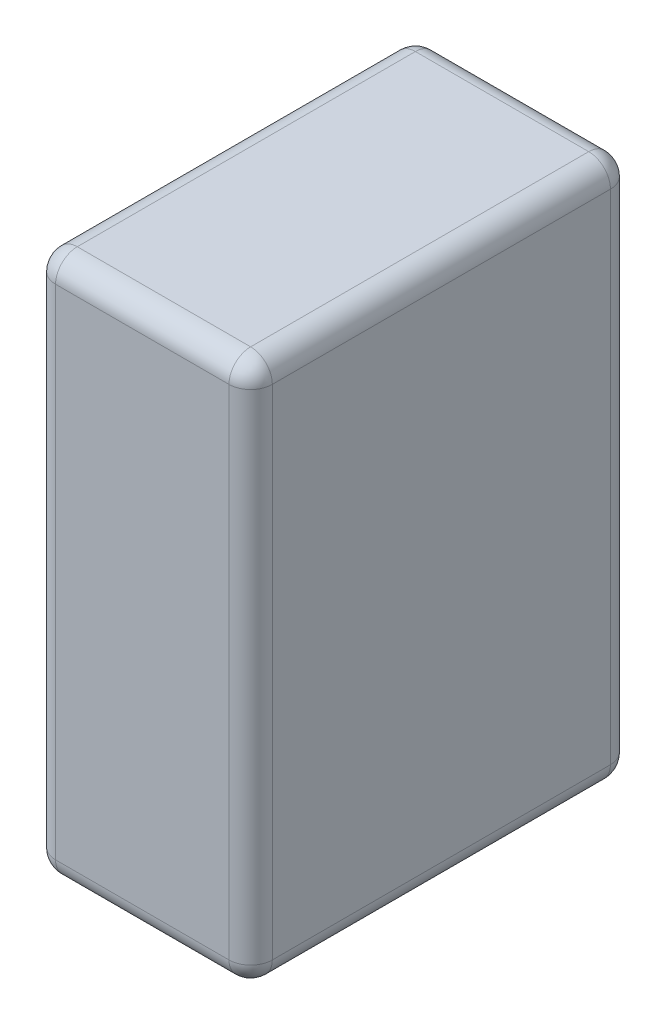
ISO-10303-21;
HEADER;
FILE_DESCRIPTION(('STEP AP214'),'2;1');
FILE_NAME('part.step','',(''),(''),'','','');
FILE_SCHEMA(('AUTOMOTIVE_DESIGN { 1 0 10303 214 1 1 1 1 }'));
ENDSEC;
DATA;
#1=APPLICATION_CONTEXT('core data for automotive mechanical design processes');
#2=APPLICATION_PROTOCOL_DEFINITION('international standard','automotive_design',2000,#1);
#3=PRODUCT_CONTEXT('',#1,'mechanical');
#4=PRODUCT('Part','Part','',(#3));
#5=PRODUCT_RELATED_PRODUCT_CATEGORY('part','',(#4));
#6=PRODUCT_DEFINITION_FORMATION('','',#4);
#7=PRODUCT_DEFINITION_CONTEXT('part definition',#1,'design');
#8=PRODUCT_DEFINITION('design','',#6,#7);
#9=PRODUCT_DEFINITION_SHAPE('','',#8);
#10=(LENGTH_UNIT() NAMED_UNIT(*) SI_UNIT(.MILLI.,.METRE.));
#11=(NAMED_UNIT(*) PLANE_ANGLE_UNIT() SI_UNIT($,.RADIAN.));
#12=(NAMED_UNIT(*) SI_UNIT($,.STERADIAN.) SOLID_ANGLE_UNIT());
#13=UNCERTAINTY_MEASURE_WITH_UNIT(LENGTH_MEASURE(1.E-05),#10,'distance_accuracy_value','');
#14=(GEOMETRIC_REPRESENTATION_CONTEXT(3) GLOBAL_UNCERTAINTY_ASSIGNED_CONTEXT((#13)) GLOBAL_UNIT_ASSIGNED_CONTEXT((#10,
#11,#12)) REPRESENTATION_CONTEXT('',''));
#15=CARTESIAN_POINT('',(0.,0.,0.));
#16=DIRECTION('',(0.,0.,1.));
#17=DIRECTION('',(1.,0.,0.));
#18=AXIS2_PLACEMENT_3D('',#15,#16,#17);
#19=CARTESIAN_POINT('',(0.5,-0.625,0.));
#20=DIRECTION('',(1.,0.,0.));
#21=DIRECTION('',(0.,0.,1.));
#22=AXIS2_PLACEMENT_3D('',#19,#20,#21);
#23=PLANE('',#22);
#24=DIRECTION('',(0.,1.,0.));
#25=VECTOR('',#24,1.);
#26=CARTESIAN_POINT('',(0.5,-0.575,0.83));
#27=LINE('',#26,#25);
#28=CARTESIAN_POINT('',(0.5,-0.575,0.83));
#29=VERTEX_POINT('',#28);
#30=CARTESIAN_POINT('',(0.5,0.575,0.83));
#31=VERTEX_POINT('',#30);
#32=EDGE_CURVE('E11',#29,#31,#27,.T.);
#33=ORIENTED_EDGE('',*,*,#32,.T.);
#34=DIRECTION('',(0.,0.,1.));
#35=VECTOR('',#34,1.);
#36=CARTESIAN_POINT('',(0.5,0.575,0.05));
#37=LINE('',#36,#35);
#38=CARTESIAN_POINT('',(0.5,0.575,0.05));
#39=VERTEX_POINT('',#38);
#40=EDGE_CURVE('E241',#39,#31,#37,.T.);
#41=ORIENTED_EDGE('',*,*,#40,.F.);
#42=DIRECTION('',(0.,1.,0.));
#43=VECTOR('',#42,1.);
#44=CARTESIAN_POINT('',(0.5,-0.575,0.05));
#45=LINE('',#44,#43);
#46=CARTESIAN_POINT('',(0.5,-0.575,0.05));
#47=VERTEX_POINT('',#46);
#48=EDGE_CURVE('E238',#47,#39,#45,.T.);
#49=ORIENTED_EDGE('',*,*,#48,.F.);
#50=DIRECTION('',(0.,0.,1.));
#51=VECTOR('',#50,1.);
#52=CARTESIAN_POINT('',(0.5,-0.575,0.05));
#53=LINE('',#52,#51);
#54=EDGE_CURVE('E24',#47,#29,#53,.T.);
#55=ORIENTED_EDGE('',*,*,#54,.T.);
#56=EDGE_LOOP('',(#33,#41,#49,#55));
#57=FACE_BOUND('',#56,.T.);
#58=ADVANCED_FACE('F17',(#57),#23,.F.);
#59=CARTESIAN_POINT('',(0.55,-0.575,0.));
#60=DIRECTION('',(0.,0.,1.));
#61=DIRECTION('',(-1.,0.,0.));
#62=AXIS2_PLACEMENT_3D('',#59,#60,#61);
#63=CYLINDRICAL_SURFACE('',#62,0.05);
#64=ORIENTED_EDGE('',*,*,#54,.F.);
#65=CARTESIAN_POINT('',(0.55,-0.575,0.05));
#66=DIRECTION('',(0.,0.,1.));
#67=DIRECTION('',(-1.,0.,0.));
#68=AXIS2_PLACEMENT_3D('',#65,#66,#67);
#69=CIRCLE('',#68,0.05);
#70=CARTESIAN_POINT('',(0.55,-0.625,0.05));
#71=VERTEX_POINT('',#70);
#72=EDGE_CURVE('E236',#47,#71,#69,.T.);
#73=ORIENTED_EDGE('',*,*,#72,.T.);
#74=DIRECTION('',(0.,0.,1.));
#75=VECTOR('',#74,1.);
#76=CARTESIAN_POINT('',(0.55,-0.625,0.05));
#77=LINE('',#76,#75);
#78=CARTESIAN_POINT('',(0.55,-0.625,0.83));
#79=VERTEX_POINT('',#78);
#80=EDGE_CURVE('E228',#71,#79,#77,.T.);
#81=ORIENTED_EDGE('',*,*,#80,.T.);
#82=CARTESIAN_POINT('',(0.55,-0.575,0.83));
#83=DIRECTION('',(0.,0.,1.));
#84=DIRECTION('',(-1.,0.,0.));
#85=AXIS2_PLACEMENT_3D('',#82,#83,#84);
#86=CIRCLE('',#85,0.05);
#87=EDGE_CURVE('E217',#29,#79,#86,.T.);
#88=ORIENTED_EDGE('',*,*,#87,.F.);
#89=EDGE_LOOP('',(#64,#73,#81,#88));
#90=FACE_BOUND('',#89,.T.);
#91=ADVANCED_FACE('F243',(#90),#63,.T.);
#92=CARTESIAN_POINT('',(0.55,-0.625,0.05));
#93=DIRECTION('',(0.,1.,0.));
#94=DIRECTION('',(-1.,0.,0.));
#95=AXIS2_PLACEMENT_3D('',#92,#93,#94);
#96=CYLINDRICAL_SURFACE('',#95,0.05);
#97=ORIENTED_EDGE('',*,*,#48,.T.);
#98=CARTESIAN_POINT('',(0.55,0.575,0.05));
#99=DIRECTION('',(0.,1.,0.));
#100=DIRECTION('',(0.,0.,-1.));
#101=AXIS2_PLACEMENT_3D('',#98,#99,#100);
#102=CIRCLE('',#101,0.05);
#103=CARTESIAN_POINT('',(0.55,0.575,0.));
#104=VERTEX_POINT('',#103);
#105=EDGE_CURVE('E230',#104,#39,#102,.T.);
#106=ORIENTED_EDGE('',*,*,#105,.F.);
#107=DIRECTION('',(0.,1.,0.));
#108=VECTOR('',#107,1.);
#109=CARTESIAN_POINT('',(0.55,-0.575,0.));
#110=LINE('',#109,#108);
#111=CARTESIAN_POINT('',(0.55,-0.575,0.));
#112=VERTEX_POINT('',#111);
#113=EDGE_CURVE('E220',#112,#104,#110,.T.);
#114=ORIENTED_EDGE('',*,*,#113,.F.);
#115=CARTESIAN_POINT('',(0.55,-0.575,0.05));
#116=DIRECTION('',(0.,1.,0.));
#117=DIRECTION('',(0.,0.,-1.));
#118=AXIS2_PLACEMENT_3D('',#115,#116,#117);
#119=CIRCLE('',#118,0.05);
#120=EDGE_CURVE('E205',#112,#47,#119,.T.);
#121=ORIENTED_EDGE('',*,*,#120,.T.);
#122=EDGE_LOOP('',(#97,#106,#114,#121));
#123=FACE_BOUND('',#122,.T.);
#124=ADVANCED_FACE('F270',(#123),#96,.T.);
#125=CARTESIAN_POINT('',(0.55,-0.625,0.83));
#126=DIRECTION('',(0.,1.,0.));
#127=DIRECTION('',(-1.,0.,0.));
#128=AXIS2_PLACEMENT_3D('',#125,#126,#127);
#129=CYLINDRICAL_SURFACE('',#128,0.05);
#130=CARTESIAN_POINT('',(0.55,-0.575,0.83));
#131=DIRECTION('',(0.,-1.,0.));
#132=DIRECTION('',(0.,0.,1.));
#133=AXIS2_PLACEMENT_3D('',#130,#131,#132);
#134=CIRCLE('',#133,0.05);
#135=CARTESIAN_POINT('',(0.55,-0.575,0.88));
#136=VERTEX_POINT('',#135);
#137=EDGE_CURVE('E233',#136,#29,#134,.T.);
#138=ORIENTED_EDGE('',*,*,#137,.F.);
#139=DIRECTION('',(0.,1.,0.));
#140=VECTOR('',#139,1.);
#141=CARTESIAN_POINT('',(0.55,-0.575,0.88));
#142=LINE('',#141,#140);
#143=CARTESIAN_POINT('',(0.55,0.575,0.88));
#144=VERTEX_POINT('',#143);
#145=EDGE_CURVE('E223',#136,#144,#142,.T.);
#146=ORIENTED_EDGE('',*,*,#145,.T.);
#147=CARTESIAN_POINT('',(0.55,0.575,0.83));
#148=DIRECTION('',(0.,1.,0.));
#149=DIRECTION('',(-1.,0.,0.));
#150=AXIS2_PLACEMENT_3D('',#147,#148,#149);
#151=CIRCLE('',#150,0.05);
#152=EDGE_CURVE('E208',#31,#144,#151,.T.);
#153=ORIENTED_EDGE('',*,*,#152,.F.);
#154=ORIENTED_EDGE('',*,*,#32,.F.);
#155=EDGE_LOOP('',(#138,#146,#153,#154));
#156=FACE_BOUND('',#155,.T.);
#157=ADVANCED_FACE('F251',(#156),#129,.T.);
#158=CARTESIAN_POINT('',(0.55,0.575,0.));
#159=DIRECTION('',(0.,0.,1.));
#160=DIRECTION('',(-1.,0.,0.));
#161=AXIS2_PLACEMENT_3D('',#158,#159,#160);
#162=CYLINDRICAL_SURFACE('',#161,0.05);
#163=CARTESIAN_POINT('',(0.55,0.575,0.83));
#164=DIRECTION('',(0.,0.,1.));
#165=DIRECTION('',(0.,1.,0.));
#166=AXIS2_PLACEMENT_3D('',#163,#164,#165);
#167=CIRCLE('',#166,0.05);
#168=CARTESIAN_POINT('',(0.55,0.625,0.83));
#169=VERTEX_POINT('',#168);
#170=EDGE_CURVE('E225',#169,#31,#167,.T.);
#171=ORIENTED_EDGE('',*,*,#170,.F.);
#172=DIRECTION('',(0.,0.,1.));
#173=VECTOR('',#172,1.);
#174=CARTESIAN_POINT('',(0.55,0.625,0.05));
#175=LINE('',#174,#173);
#176=CARTESIAN_POINT('',(0.55,0.625,0.05));
#177=VERTEX_POINT('',#176);
#178=EDGE_CURVE('E211',#177,#169,#175,.T.);
#179=ORIENTED_EDGE('',*,*,#178,.F.);
#180=CARTESIAN_POINT('',(0.55,0.575,0.05));
#181=DIRECTION('',(0.,0.,-1.));
#182=DIRECTION('',(-1.,0.,0.));
#183=AXIS2_PLACEMENT_3D('',#180,#181,#182);
#184=CIRCLE('',#183,0.05);
#185=EDGE_CURVE('E202',#39,#177,#184,.T.);
#186=ORIENTED_EDGE('',*,*,#185,.F.);
#187=ORIENTED_EDGE('',*,*,#40,.T.);
#188=EDGE_LOOP('',(#171,#179,#186,#187));
#189=FACE_BOUND('',#188,.T.);
#190=ADVANCED_FACE('F257',(#189),#162,.T.);
#191=CARTESIAN_POINT('',(0.55,-0.575,0.05));
#192=DIRECTION('',(0.,0.,1.));
#193=DIRECTION('',(-1.,0.,0.));
#194=AXIS2_PLACEMENT_3D('',#191,#192,#193);
#195=SPHERICAL_SURFACE('',#194,0.05);
#196=CARTESIAN_POINT('',(0.55,-0.575,0.05));
#197=DIRECTION('',(-1.,0.,0.));
#198=DIRECTION('',(0.,0.,-1.));
#199=AXIS2_PLACEMENT_3D('',#196,#197,#198);
#200=CIRCLE('',#199,0.05);
#201=EDGE_CURVE('E214',#112,#71,#200,.T.);
#202=ORIENTED_EDGE('',*,*,#201,.T.);
#203=ORIENTED_EDGE('',*,*,#72,.F.);
#204=ORIENTED_EDGE('',*,*,#120,.F.);
#205=EDGE_LOOP('',(#202,#203,#204));
#206=FACE_BOUND('',#205,.T.);
#207=ADVANCED_FACE('F275',(#206),#195,.T.);
#208=CARTESIAN_POINT('',(0.55,-0.575,0.83));
#209=DIRECTION('',(0.,0.,-1.));
#210=DIRECTION('',(-1.,0.,0.));
#211=AXIS2_PLACEMENT_3D('',#208,#209,#210);
#212=SPHERICAL_SURFACE('',#211,0.05);
#213=ORIENTED_EDGE('',*,*,#137,.T.);
#214=ORIENTED_EDGE('',*,*,#87,.T.);
#215=CARTESIAN_POINT('',(0.55,-0.575,0.83));
#216=DIRECTION('',(1.,0.,0.));
#217=DIRECTION('',(0.,0.,1.));
#218=AXIS2_PLACEMENT_3D('',#215,#216,#217);
#219=CIRCLE('',#218,0.05);
#220=EDGE_CURVE('E193',#136,#79,#219,.T.);
#221=ORIENTED_EDGE('',*,*,#220,.F.);
#222=EDGE_LOOP('',(#213,#214,#221));
#223=FACE_BOUND('',#222,.T.);
#224=ADVANCED_FACE('F248',(#223),#212,.T.);
#225=CARTESIAN_POINT('',(0.5,-0.625,0.));
#226=DIRECTION('',(0.,1.,0.));
#227=DIRECTION('',(0.,0.,1.));
#228=AXIS2_PLACEMENT_3D('',#225,#226,#227);
#229=PLANE('',#228);
#230=DIRECTION('',(1.,0.,0.));
#231=VECTOR('',#230,1.);
#232=CARTESIAN_POINT('',(0.55,-0.625,0.05));
#233=LINE('',#232,#231);
#234=CARTESIAN_POINT('',(0.95,-0.625,0.05));
#235=VERTEX_POINT('',#234);
#236=EDGE_CURVE('E200',#71,#235,#233,.T.);
#237=ORIENTED_EDGE('',*,*,#236,.T.);
#238=DIRECTION('',(0.,0.,1.));
#239=VECTOR('',#238,1.);
#240=CARTESIAN_POINT('',(0.95,-0.625,0.05));
#241=LINE('',#240,#239);
#242=CARTESIAN_POINT('',(0.95,-0.625,0.83));
#243=VERTEX_POINT('',#242);
#244=EDGE_CURVE('E196',#235,#243,#241,.T.);
#245=ORIENTED_EDGE('',*,*,#244,.T.);
#246=DIRECTION('',(1.,0.,0.));
#247=VECTOR('',#246,1.);
#248=CARTESIAN_POINT('',(0.55,-0.625,0.83));
#249=LINE('',#248,#247);
#250=EDGE_CURVE('E186',#79,#243,#249,.T.);
#251=ORIENTED_EDGE('',*,*,#250,.F.);
#252=ORIENTED_EDGE('',*,*,#80,.F.);
#253=EDGE_LOOP('',(#237,#245,#251,#252));
#254=FACE_BOUND('',#253,.T.);
#255=ADVANCED_FACE('F280',(#254),#229,.F.);
#256=CARTESIAN_POINT('',(0.5,-0.625,0.));
#257=DIRECTION('',(0.,0.,1.));
#258=DIRECTION('',(1.,0.,0.));
#259=AXIS2_PLACEMENT_3D('',#256,#257,#258);
#260=PLANE('',#259);
#261=DIRECTION('',(1.,0.,0.));
#262=VECTOR('',#261,1.);
#263=CARTESIAN_POINT('',(0.55,0.575,0.));
#264=LINE('',#263,#262);
#265=CARTESIAN_POINT('',(0.95,0.575,0.));
#266=VERTEX_POINT('',#265);
#267=EDGE_CURVE('E198',#104,#266,#264,.T.);
#268=ORIENTED_EDGE('',*,*,#267,.T.);
#269=DIRECTION('',(0.,1.,0.));
#270=VECTOR('',#269,1.);
#271=CARTESIAN_POINT('',(0.95,-0.575,0.));
#272=LINE('',#271,#270);
#273=CARTESIAN_POINT('',(0.95,-0.575,0.));
#274=VERTEX_POINT('',#273);
#275=EDGE_CURVE('E110',#274,#266,#272,.T.);
#276=ORIENTED_EDGE('',*,*,#275,.F.);
#277=DIRECTION('',(1.,0.,0.));
#278=VECTOR('',#277,1.);
#279=CARTESIAN_POINT('',(0.55,-0.575,0.));
#280=LINE('',#279,#278);
#281=EDGE_CURVE('E183',#112,#274,#280,.T.);
#282=ORIENTED_EDGE('',*,*,#281,.F.);
#283=ORIENTED_EDGE('',*,*,#113,.T.);
#284=EDGE_LOOP('',(#268,#276,#282,#283));
#285=FACE_BOUND('',#284,.T.);
#286=ADVANCED_FACE('F322',(#285),#260,.F.);
#287=CARTESIAN_POINT('',(0.55,0.575,0.05));
#288=DIRECTION('',(0.,0.,1.));
#289=DIRECTION('',(-1.,0.,0.));
#290=AXIS2_PLACEMENT_3D('',#287,#288,#289);
#291=SPHERICAL_SURFACE('',#290,0.05);
#292=CARTESIAN_POINT('',(0.55,0.575,0.05));
#293=DIRECTION('',(1.,0.,0.));
#294=DIRECTION('',(0.,0.,-1.));
#295=AXIS2_PLACEMENT_3D('',#292,#293,#294);
#296=CIRCLE('',#295,0.05);
#297=EDGE_CURVE('E190',#104,#177,#296,.T.);
#298=ORIENTED_EDGE('',*,*,#297,.F.);
#299=ORIENTED_EDGE('',*,*,#105,.T.);
#300=ORIENTED_EDGE('',*,*,#185,.T.);
#301=EDGE_LOOP('',(#298,#299,#300));
#302=FACE_BOUND('',#301,.T.);
#303=ADVANCED_FACE('F268',(#302),#291,.T.);
#304=CARTESIAN_POINT('',(0.5,-0.625,0.88));
#305=DIRECTION('',(0.,0.,1.));
#306=DIRECTION('',(1.,0.,0.));
#307=AXIS2_PLACEMENT_3D('',#304,#305,#306);
#308=PLANE('',#307);
#309=ORIENTED_EDGE('',*,*,#145,.F.);
#310=DIRECTION('',(1.,0.,0.));
#311=VECTOR('',#310,1.);
#312=CARTESIAN_POINT('',(0.55,-0.575,0.88));
#313=LINE('',#312,#311);
#314=CARTESIAN_POINT('',(0.95,-0.575,0.88));
#315=VERTEX_POINT('',#314);
#316=EDGE_CURVE('E181',#136,#315,#313,.T.);
#317=ORIENTED_EDGE('',*,*,#316,.T.);
#318=DIRECTION('',(0.,1.,0.));
#319=VECTOR('',#318,1.);
#320=CARTESIAN_POINT('',(0.95,-0.575,0.88));
#321=LINE('',#320,#319);
#322=CARTESIAN_POINT('',(0.95,0.575,0.88));
#323=VERTEX_POINT('',#322);
#324=EDGE_CURVE('E179',#315,#323,#321,.T.);
#325=ORIENTED_EDGE('',*,*,#324,.T.);
#326=DIRECTION('',(1.,0.,0.));
#327=VECTOR('',#326,1.);
#328=CARTESIAN_POINT('',(0.55,0.575,0.88));
#329=LINE('',#328,#327);
#330=EDGE_CURVE('E171',#144,#323,#329,.T.);
#331=ORIENTED_EDGE('',*,*,#330,.F.);
#332=EDGE_LOOP('',(#309,#317,#325,#331));
#333=FACE_BOUND('',#332,.T.);
#334=ADVANCED_FACE('F321',(#333),#308,.T.);
#335=CARTESIAN_POINT('',(0.55,0.575,0.83));
#336=DIRECTION('',(0.,-1.,0.));
#337=DIRECTION('',(-1.,0.,0.));
#338=AXIS2_PLACEMENT_3D('',#335,#336,#337);
#339=SPHERICAL_SURFACE('',#338,0.05);
#340=ORIENTED_EDGE('',*,*,#170,.T.);
#341=ORIENTED_EDGE('',*,*,#152,.T.);
#342=CARTESIAN_POINT('',(0.55,0.575,0.83));
#343=DIRECTION('',(1.,0.,0.));
#344=DIRECTION('',(0.,1.,0.));
#345=AXIS2_PLACEMENT_3D('',#342,#343,#344);
#346=CIRCLE('',#345,0.05);
#347=EDGE_CURVE('E174',#169,#144,#346,.T.);
#348=ORIENTED_EDGE('',*,*,#347,.F.);
#349=EDGE_LOOP('',(#340,#341,#348));
#350=FACE_BOUND('',#349,.T.);
#351=ADVANCED_FACE('F258',(#350),#339,.T.);
#352=CARTESIAN_POINT('',(0.5,0.625,0.));
#353=DIRECTION('',(0.,1.,0.));
#354=DIRECTION('',(0.,0.,1.));
#355=AXIS2_PLACEMENT_3D('',#352,#353,#354);
#356=PLANE('',#355);
#357=ORIENTED_EDGE('',*,*,#178,.T.);
#358=DIRECTION('',(1.,0.,0.));
#359=VECTOR('',#358,1.);
#360=CARTESIAN_POINT('',(0.55,0.625,0.83));
#361=LINE('',#360,#359);
#362=CARTESIAN_POINT('',(0.95,0.625,0.83));
#363=VERTEX_POINT('',#362);
#364=EDGE_CURVE('E177',#169,#363,#361,.T.);
#365=ORIENTED_EDGE('',*,*,#364,.T.);
#366=DIRECTION('',(0.,0.,1.));
#367=VECTOR('',#366,1.);
#368=CARTESIAN_POINT('',(0.95,0.625,0.05));
#369=LINE('',#368,#367);
#370=CARTESIAN_POINT('',(0.95,0.625,0.05));
#371=VERTEX_POINT('',#370);
#372=EDGE_CURVE('E169',#371,#363,#369,.T.);
#373=ORIENTED_EDGE('',*,*,#372,.F.);
#374=DIRECTION('',(1.,0.,0.));
#375=VECTOR('',#374,1.);
#376=CARTESIAN_POINT('',(0.55,0.625,0.05));
#377=LINE('',#376,#375);
#378=EDGE_CURVE('E157',#177,#371,#377,.T.);
#379=ORIENTED_EDGE('',*,*,#378,.F.);
#380=EDGE_LOOP('',(#357,#365,#373,#379));
#381=FACE_BOUND('',#380,.T.);
#382=ADVANCED_FACE('F264',(#381),#356,.T.);
#383=CARTESIAN_POINT('',(0.5,-0.575,0.05));
#384=DIRECTION('',(1.,0.,0.));
#385=DIRECTION('',(0.,-1.,0.));
#386=AXIS2_PLACEMENT_3D('',#383,#384,#385);
#387=CYLINDRICAL_SURFACE('',#386,0.05);
#388=ORIENTED_EDGE('',*,*,#201,.F.);
#389=ORIENTED_EDGE('',*,*,#281,.T.);
#390=CARTESIAN_POINT('',(0.95,-0.575,0.05));
#391=DIRECTION('',(-1.,0.,0.));
#392=DIRECTION('',(0.,0.,-1.));
#393=AXIS2_PLACEMENT_3D('',#390,#391,#392);
#394=CIRCLE('',#393,0.05);
#395=EDGE_CURVE('E160',#274,#235,#394,.T.);
#396=ORIENTED_EDGE('',*,*,#395,.T.);
#397=ORIENTED_EDGE('',*,*,#236,.F.);
#398=EDGE_LOOP('',(#388,#389,#396,#397));
#399=FACE_BOUND('',#398,.T.);
#400=ADVANCED_FACE('F281',(#399),#387,.T.);
#401=CARTESIAN_POINT('',(0.5,-0.575,0.83));
#402=DIRECTION('',(1.,0.,0.));
#403=DIRECTION('',(0.,-1.,0.));
#404=AXIS2_PLACEMENT_3D('',#401,#402,#403);
#405=CYLINDRICAL_SURFACE('',#404,0.05);
#406=ORIENTED_EDGE('',*,*,#250,.T.);
#407=CARTESIAN_POINT('',(0.95,-0.575,0.83));
#408=DIRECTION('',(1.,0.,0.));
#409=DIRECTION('',(0.,0.,1.));
#410=AXIS2_PLACEMENT_3D('',#407,#408,#409);
#411=CIRCLE('',#410,0.05);
#412=EDGE_CURVE('E163',#315,#243,#411,.T.);
#413=ORIENTED_EDGE('',*,*,#412,.F.);
#414=ORIENTED_EDGE('',*,*,#316,.F.);
#415=ORIENTED_EDGE('',*,*,#220,.T.);
#416=EDGE_LOOP('',(#406,#413,#414,#415));
#417=FACE_BOUND('',#416,.T.);
#418=ADVANCED_FACE('F335',(#417),#405,.T.);
#419=CARTESIAN_POINT('',(0.95,-0.575,0.));
#420=DIRECTION('',(0.,0.,1.));
#421=DIRECTION('',(1.,0.,0.));
#422=AXIS2_PLACEMENT_3D('',#419,#420,#421);
#423=CYLINDRICAL_SURFACE('',#422,0.05);
#424=CARTESIAN_POINT('',(0.95,-0.575,0.83));
#425=DIRECTION('',(0.,0.,-1.));
#426=DIRECTION('',(1.,0.,0.));
#427=AXIS2_PLACEMENT_3D('',#424,#425,#426);
#428=CIRCLE('',#427,0.05);
#429=CARTESIAN_POINT('',(1.,-0.575,0.83));
#430=VERTEX_POINT('',#429);
#431=EDGE_CURVE('E166',#430,#243,#428,.T.);
#432=ORIENTED_EDGE('',*,*,#431,.T.);
#433=ORIENTED_EDGE('',*,*,#244,.F.);
#434=CARTESIAN_POINT('',(0.95,-0.575,0.05));
#435=DIRECTION('',(0.,0.,-1.));
#436=DIRECTION('',(1.,0.,0.));
#437=AXIS2_PLACEMENT_3D('',#434,#435,#436);
#438=CIRCLE('',#437,0.05);
#439=CARTESIAN_POINT('',(1.,-0.575,0.05));
#440=VERTEX_POINT('',#439);
#441=EDGE_CURVE('E151',#440,#235,#438,.T.);
#442=ORIENTED_EDGE('',*,*,#441,.F.);
#443=DIRECTION('',(0.,0.,1.));
#444=VECTOR('',#443,1.);
#445=CARTESIAN_POINT('',(1.,-0.575,0.05));
#446=LINE('',#445,#444);
#447=EDGE_CURVE('E132',#440,#430,#446,.T.);
#448=ORIENTED_EDGE('',*,*,#447,.T.);
#449=EDGE_LOOP('',(#432,#433,#442,#448));
#450=FACE_BOUND('',#449,.T.);
#451=ADVANCED_FACE('F286',(#450),#423,.T.);
#452=CARTESIAN_POINT('',(0.5,0.575,0.05));
#453=DIRECTION('',(1.,0.,0.));
#454=DIRECTION('',(0.,1.,0.));
#455=AXIS2_PLACEMENT_3D('',#452,#453,#454);
#456=CYLINDRICAL_SURFACE('',#455,0.05);
#457=ORIENTED_EDGE('',*,*,#378,.T.);
#458=CARTESIAN_POINT('',(0.95,0.575,0.05));
#459=DIRECTION('',(1.,0.,0.));
#460=DIRECTION('',(0.,0.,-1.));
#461=AXIS2_PLACEMENT_3D('',#458,#459,#460);
#462=CIRCLE('',#461,0.05);
#463=EDGE_CURVE('E138',#266,#371,#462,.T.);
#464=ORIENTED_EDGE('',*,*,#463,.F.);
#465=ORIENTED_EDGE('',*,*,#267,.F.);
#466=ORIENTED_EDGE('',*,*,#297,.T.);
#467=EDGE_LOOP('',(#457,#464,#465,#466));
#468=FACE_BOUND('',#467,.T.);
#469=ADVANCED_FACE('F338',(#468),#456,.T.);
#470=CARTESIAN_POINT('',(0.95,-0.625,0.05));
#471=DIRECTION('',(0.,1.,0.));
#472=DIRECTION('',(1.,0.,0.));
#473=AXIS2_PLACEMENT_3D('',#470,#471,#472);
#474=CYLINDRICAL_SURFACE('',#473,0.05);
#475=CARTESIAN_POINT('',(0.95,-0.575,0.05));
#476=DIRECTION('',(0.,-1.,0.));
#477=DIRECTION('',(0.,0.,-1.));
#478=AXIS2_PLACEMENT_3D('',#475,#476,#477);
#479=CIRCLE('',#478,0.05);
#480=EDGE_CURVE('E155',#274,#440,#479,.T.);
#481=ORIENTED_EDGE('',*,*,#480,.F.);
#482=ORIENTED_EDGE('',*,*,#275,.T.);
#483=CARTESIAN_POINT('',(0.95,0.575,0.05));
#484=DIRECTION('',(0.,-1.,0.));
#485=DIRECTION('',(0.,0.,-1.));
#486=AXIS2_PLACEMENT_3D('',#483,#484,#485);
#487=CIRCLE('',#486,0.05);
#488=CARTESIAN_POINT('',(1.,0.575,0.05));
#489=VERTEX_POINT('',#488);
#490=EDGE_CURVE('E103',#266,#489,#487,.T.);
#491=ORIENTED_EDGE('',*,*,#490,.T.);
#492=DIRECTION('',(0.,1.,0.));
#493=VECTOR('',#492,1.);
#494=CARTESIAN_POINT('',(1.,-0.575,0.05));
#495=LINE('',#494,#493);
#496=EDGE_CURVE('E108',#440,#489,#495,.T.);
#497=ORIENTED_EDGE('',*,*,#496,.F.);
#498=EDGE_LOOP('',(#481,#482,#491,#497));
#499=FACE_BOUND('',#498,.T.);
#500=ADVANCED_FACE('F106',(#499),#474,.T.);
#501=CARTESIAN_POINT('',(0.5,0.575,0.83));
#502=DIRECTION('',(1.,0.,0.));
#503=DIRECTION('',(0.,1.,0.));
#504=AXIS2_PLACEMENT_3D('',#501,#502,#503);
#505=CYLINDRICAL_SURFACE('',#504,0.05);
#506=ORIENTED_EDGE('',*,*,#347,.T.);
#507=ORIENTED_EDGE('',*,*,#330,.T.);
#508=CARTESIAN_POINT('',(0.95,0.575,0.83));
#509=DIRECTION('',(1.,0.,0.));
#510=DIRECTION('',(0.,1.,0.));
#511=AXIS2_PLACEMENT_3D('',#508,#509,#510);
#512=CIRCLE('',#511,0.05);
#513=EDGE_CURVE('E134',#363,#323,#512,.T.);
#514=ORIENTED_EDGE('',*,*,#513,.F.);
#515=ORIENTED_EDGE('',*,*,#364,.F.);
#516=EDGE_LOOP('',(#506,#507,#514,#515));
#517=FACE_BOUND('',#516,.T.);
#518=ADVANCED_FACE('F262',(#517),#505,.T.);
#519=CARTESIAN_POINT('',(0.95,-0.625,0.83));
#520=DIRECTION('',(0.,1.,0.));
#521=DIRECTION('',(1.,0.,0.));
#522=AXIS2_PLACEMENT_3D('',#519,#520,#521);
#523=CYLINDRICAL_SURFACE('',#522,0.05);
#524=DIRECTION('',(0.,1.,0.));
#525=VECTOR('',#524,1.);
#526=CARTESIAN_POINT('',(1.,-0.575,0.83));
#527=LINE('',#526,#525);
#528=CARTESIAN_POINT('',(1.,0.575,0.83));
#529=VERTEX_POINT('',#528);
#530=EDGE_CURVE('E114',#430,#529,#527,.T.);
#531=ORIENTED_EDGE('',*,*,#530,.T.);
#532=CARTESIAN_POINT('',(0.95,0.575,0.83));
#533=DIRECTION('',(0.,-1.,0.));
#534=DIRECTION('',(1.,0.,0.));
#535=AXIS2_PLACEMENT_3D('',#532,#533,#534);
#536=CIRCLE('',#535,0.05);
#537=EDGE_CURVE('E129',#529,#323,#536,.T.);
#538=ORIENTED_EDGE('',*,*,#537,.T.);
#539=ORIENTED_EDGE('',*,*,#324,.F.);
#540=CARTESIAN_POINT('',(0.95,-0.575,0.83));
#541=DIRECTION('',(0.,1.,0.));
#542=DIRECTION('',(0.,0.,1.));
#543=AXIS2_PLACEMENT_3D('',#540,#541,#542);
#544=CIRCLE('',#543,0.05);
#545=EDGE_CURVE('E139',#315,#430,#544,.T.);
#546=ORIENTED_EDGE('',*,*,#545,.T.);
#547=EDGE_LOOP('',(#531,#538,#539,#546));
#548=FACE_BOUND('',#547,.T.);
#549=ADVANCED_FACE('F299',(#548),#523,.T.);
#550=CARTESIAN_POINT('',(0.95,0.575,0.));
#551=DIRECTION('',(0.,0.,1.));
#552=DIRECTION('',(1.,0.,0.));
#553=AXIS2_PLACEMENT_3D('',#550,#551,#552);
#554=CYLINDRICAL_SURFACE('',#553,0.05);
#555=DIRECTION('',(0.,0.,1.));
#556=VECTOR('',#555,1.);
#557=CARTESIAN_POINT('',(1.,0.575,0.05));
#558=LINE('',#557,#556);
#559=EDGE_CURVE('E115',#489,#529,#558,.T.);
#560=ORIENTED_EDGE('',*,*,#559,.F.);
#561=CARTESIAN_POINT('',(0.95,0.575,0.05));
#562=DIRECTION('',(0.,0.,1.));
#563=DIRECTION('',(1.,0.,0.));
#564=AXIS2_PLACEMENT_3D('',#561,#562,#563);
#565=CIRCLE('',#564,0.05);
#566=EDGE_CURVE('E123',#489,#371,#565,.T.);
#567=ORIENTED_EDGE('',*,*,#566,.T.);
#568=ORIENTED_EDGE('',*,*,#372,.T.);
#569=CARTESIAN_POINT('',(0.95,0.575,0.83));
#570=DIRECTION('',(0.,0.,-1.));
#571=DIRECTION('',(0.,1.,0.));
#572=AXIS2_PLACEMENT_3D('',#569,#570,#571);
#573=CIRCLE('',#572,0.05);
#574=EDGE_CURVE('E125',#363,#529,#573,.T.);
#575=ORIENTED_EDGE('',*,*,#574,.T.);
#576=EDGE_LOOP('',(#560,#567,#568,#575));
#577=FACE_BOUND('',#576,.T.);
#578=ADVANCED_FACE('F121',(#577),#554,.T.);
#579=CARTESIAN_POINT('',(0.95,-0.575,0.05));
#580=DIRECTION('',(0.,0.,1.));
#581=DIRECTION('',(1.,0.,0.));
#582=AXIS2_PLACEMENT_3D('',#579,#580,#581);
#583=SPHERICAL_SURFACE('',#582,0.05);
#584=ORIENTED_EDGE('',*,*,#441,.T.);
#585=ORIENTED_EDGE('',*,*,#395,.F.);
#586=ORIENTED_EDGE('',*,*,#480,.T.);
#587=EDGE_LOOP('',(#584,#585,#586));
#588=FACE_BOUND('',#587,.T.);
#589=ADVANCED_FACE('F288',(#588),#583,.T.);
#590=CARTESIAN_POINT('',(0.95,-0.575,0.83));
#591=DIRECTION('',(0.,0.,-1.));
#592=DIRECTION('',(1.,0.,0.));
#593=AXIS2_PLACEMENT_3D('',#590,#591,#592);
#594=SPHERICAL_SURFACE('',#593,0.05);
#595=ORIENTED_EDGE('',*,*,#545,.F.);
#596=ORIENTED_EDGE('',*,*,#412,.T.);
#597=ORIENTED_EDGE('',*,*,#431,.F.);
#598=EDGE_LOOP('',(#595,#596,#597));
#599=FACE_BOUND('',#598,.T.);
#600=ADVANCED_FACE('F290',(#599),#594,.T.);
#601=CARTESIAN_POINT('',(1.,-0.625,0.));
#602=DIRECTION('',(1.,0.,0.));
#603=DIRECTION('',(0.,0.,1.));
#604=AXIS2_PLACEMENT_3D('',#601,#602,#603);
#605=PLANE('',#604);
#606=ORIENTED_EDGE('',*,*,#447,.F.);
#607=ORIENTED_EDGE('',*,*,#496,.T.);
#608=ORIENTED_EDGE('',*,*,#559,.T.);
#609=ORIENTED_EDGE('',*,*,#530,.F.);
#610=EDGE_LOOP('',(#606,#607,#608,#609));
#611=FACE_BOUND('',#610,.T.);
#612=ADVANCED_FACE('F131',(#611),#605,.T.);
#613=CARTESIAN_POINT('',(0.95,0.575,0.05));
#614=DIRECTION('',(0.,0.,1.));
#615=DIRECTION('',(1.,0.,0.));
#616=AXIS2_PLACEMENT_3D('',#613,#614,#615);
#617=SPHERICAL_SURFACE('',#616,0.05);
#618=ORIENTED_EDGE('',*,*,#490,.F.);
#619=ORIENTED_EDGE('',*,*,#463,.T.);
#620=ORIENTED_EDGE('',*,*,#566,.F.);
#621=EDGE_LOOP('',(#618,#619,#620));
#622=FACE_BOUND('',#621,.T.);
#623=ADVANCED_FACE('F136',(#622),#617,.T.);
#624=CARTESIAN_POINT('',(0.95,0.575,0.83));
#625=DIRECTION('',(0.,-1.,0.));
#626=DIRECTION('',(1.,0.,0.));
#627=AXIS2_PLACEMENT_3D('',#624,#625,#626);
#628=SPHERICAL_SURFACE('',#627,0.05);
#629=ORIENTED_EDGE('',*,*,#574,.F.);
#630=ORIENTED_EDGE('',*,*,#513,.T.);
#631=ORIENTED_EDGE('',*,*,#537,.F.);
#632=EDGE_LOOP('',(#629,#630,#631));
#633=FACE_BOUND('',#632,.T.);
#634=ADVANCED_FACE('F401',(#633),#628,.T.);
#635=CLOSED_SHELL('',(#58,#91,#124,#157,#190,#207,#224,#255,#286,#303,#334,#351,#382,#400,#418,
#451,#469,#500,#518,#549,#578,#589,#600,#612,#623,#634));
#636=MANIFOLD_SOLID_BREP('B1',#635);
#637=ADVANCED_BREP_SHAPE_REPRESENTATION('',(#18,#636),#14);
#638=SHAPE_DEFINITION_REPRESENTATION(#9,#637);
ENDSEC;
END-ISO-10303-21;
